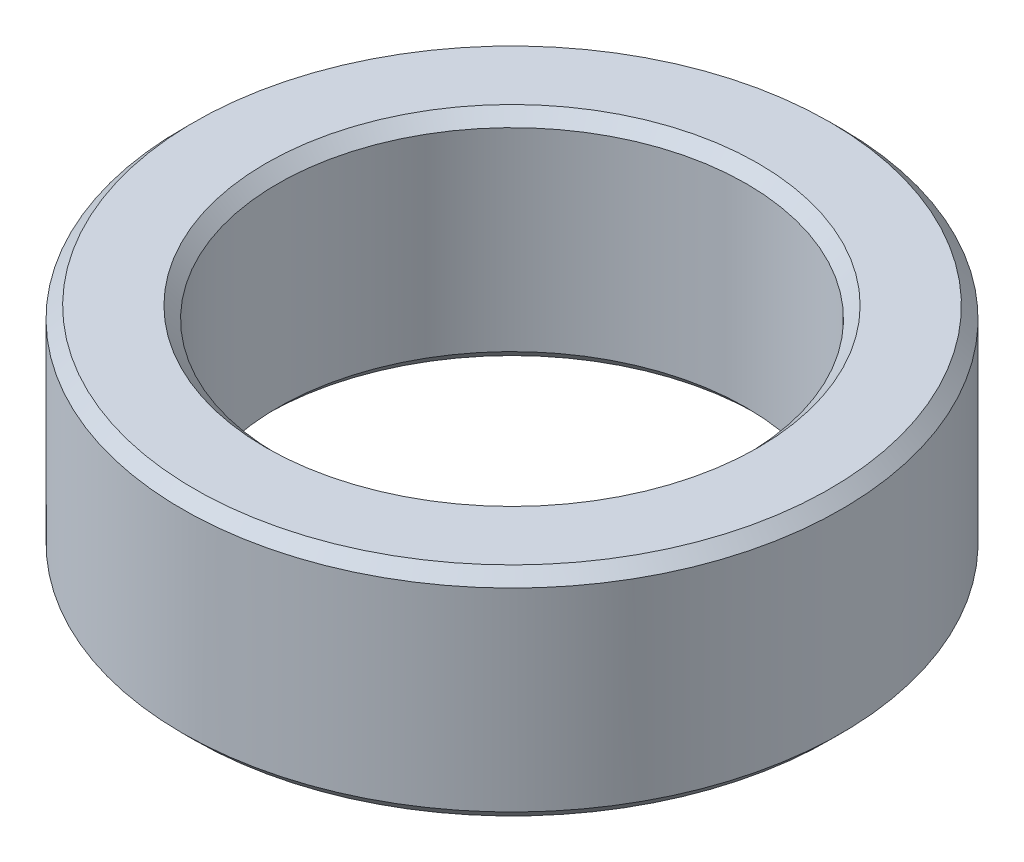
ISO-10303-21;
HEADER;
FILE_DESCRIPTION(('STEP AP214'),'2;1');
FILE_NAME('part.step','',(''),(''),'','','');
FILE_SCHEMA(('AUTOMOTIVE_DESIGN { 1 0 10303 214 1 1 1 1 }'));
ENDSEC;
DATA;
#1=APPLICATION_CONTEXT('core data for automotive mechanical design processes');
#2=APPLICATION_PROTOCOL_DEFINITION('international standard','automotive_design',2000,#1);
#3=PRODUCT_CONTEXT('',#1,'mechanical');
#4=PRODUCT('Part','Part','',(#3));
#5=PRODUCT_RELATED_PRODUCT_CATEGORY('part','',(#4));
#6=PRODUCT_DEFINITION_FORMATION('','',#4);
#7=PRODUCT_DEFINITION_CONTEXT('part definition',#1,'design');
#8=PRODUCT_DEFINITION('design','',#6,#7);
#9=PRODUCT_DEFINITION_SHAPE('','',#8);
#10=(LENGTH_UNIT() NAMED_UNIT(*) SI_UNIT(.MILLI.,.METRE.));
#11=(NAMED_UNIT(*) PLANE_ANGLE_UNIT() SI_UNIT($,.RADIAN.));
#12=(NAMED_UNIT(*) SI_UNIT($,.STERADIAN.) SOLID_ANGLE_UNIT());
#13=UNCERTAINTY_MEASURE_WITH_UNIT(LENGTH_MEASURE(1.E-05),#10,'distance_accuracy_value','');
#14=(GEOMETRIC_REPRESENTATION_CONTEXT(3) GLOBAL_UNCERTAINTY_ASSIGNED_CONTEXT((#13)) GLOBAL_UNIT_ASSIGNED_CONTEXT((#10,
#11,#12)) REPRESENTATION_CONTEXT('',''));
#15=CARTESIAN_POINT('',(0.,0.,0.));
#16=DIRECTION('',(0.,0.,1.));
#17=DIRECTION('',(1.,0.,0.));
#18=AXIS2_PLACEMENT_3D('',#15,#16,#17);
#19=CARTESIAN_POINT('',(0.,32.9915013435077,0.));
#20=DIRECTION('',(0.,-1.,0.));
#21=DIRECTION('',(0.,0.,-1.));
#22=AXIS2_PLACEMENT_3D('',#19,#20,#21);
#23=CYLINDRICAL_SURFACE('',#22,50.);
#24=CARTESIAN_POINT('',(0.,1.78442094857238,0.));
#25=DIRECTION('',(0.,1.,0.));
#26=DIRECTION('',(0.,0.,1.));
#27=AXIS2_PLACEMENT_3D('',#24,#25,#26);
#28=CIRCLE('',#27,50.);
#29=CARTESIAN_POINT('',(0.,1.78442094857238,50.));
#30=VERTEX_POINT('',#29);
#31=EDGE_CURVE('E10',#30,#30,#28,.T.);
#32=ORIENTED_EDGE('',*,*,#31,.T.);
#33=EDGE_LOOP('',(#32));
#34=FACE_BOUND('',#33,.T.);
#35=CARTESIAN_POINT('',(0.,31.2070803949353,0.));
#36=DIRECTION('',(0.,1.,0.));
#37=DIRECTION('',(0.,0.,1.));
#38=AXIS2_PLACEMENT_3D('',#35,#36,#37);
#39=CIRCLE('',#38,50.);
#40=CARTESIAN_POINT('',(0.,31.2070803949353,-50.));
#41=VERTEX_POINT('',#40);
#42=EDGE_CURVE('E50',#41,#41,#39,.F.);
#43=ORIENTED_EDGE('',*,*,#42,.T.);
#44=EDGE_LOOP('',(#43));
#45=FACE_BOUND('',#44,.T.);
#46=ADVANCED_FACE('F39',(#34,#45),#23,.T.);
#47=CARTESIAN_POINT('',(0.,32.9915013435077,0.));
#48=DIRECTION('',(0.,1.,0.));
#49=DIRECTION('',(0.,0.,1.));
#50=AXIS2_PLACEMENT_3D('',#47,#48,#49);
#51=PLANE('',#50);
#52=CARTESIAN_POINT('',(0.,32.9915013435077,0.));
#53=DIRECTION('',(0.,1.,0.));
#54=DIRECTION('',(0.,0.,1.));
#55=AXIS2_PLACEMENT_3D('',#52,#53,#54);
#56=CIRCLE('',#55,37.349321574819);
#57=CARTESIAN_POINT('',(0.,32.9915013435077,37.349321574819));
#58=VERTEX_POINT('',#57);
#59=EDGE_CURVE('E58',#58,#58,#56,.F.);
#60=ORIENTED_EDGE('',*,*,#59,.T.);
#61=EDGE_LOOP('',(#60));
#62=FACE_BOUND('',#61,.T.);
#63=CARTESIAN_POINT('',(0.,32.9915013435077,0.));
#64=DIRECTION('',(0.,1.,0.));
#65=DIRECTION('',(0.,0.,1.));
#66=AXIS2_PLACEMENT_3D('',#63,#64,#65);
#67=CIRCLE('',#66,48.2155790514276);
#68=CARTESIAN_POINT('',(0.,32.9915013435077,-48.2155790514276));
#69=VERTEX_POINT('',#68);
#70=EDGE_CURVE('E61',#69,#69,#67,.T.);
#71=ORIENTED_EDGE('',*,*,#70,.T.);
#72=EDGE_LOOP('',(#71));
#73=FACE_BOUND('',#72,.T.);
#74=ADVANCED_FACE('F88',(#62,#73),#51,.T.);
#75=CARTESIAN_POINT('',(0.,0.,0.));
#76=DIRECTION('',(0.,1.,0.));
#77=DIRECTION('',(0.,0.,1.));
#78=AXIS2_PLACEMENT_3D('',#75,#76,#77);
#79=PLANE('',#78);
#80=CARTESIAN_POINT('',(0.,0.,0.));
#81=DIRECTION('',(0.,1.,0.));
#82=DIRECTION('',(0.,0.,1.));
#83=AXIS2_PLACEMENT_3D('',#80,#81,#82);
#84=CIRCLE('',#83,37.349321574819);
#85=CARTESIAN_POINT('',(0.,0.,37.349321574819));
#86=VERTEX_POINT('',#85);
#87=EDGE_CURVE('E51',#86,#86,#84,.T.);
#88=ORIENTED_EDGE('',*,*,#87,.T.);
#89=EDGE_LOOP('',(#88));
#90=FACE_BOUND('',#89,.T.);
#91=CARTESIAN_POINT('',(0.,0.,0.));
#92=DIRECTION('',(0.,1.,0.));
#93=DIRECTION('',(0.,0.,1.));
#94=AXIS2_PLACEMENT_3D('',#91,#92,#93);
#95=CIRCLE('',#94,48.2155790514276);
#96=CARTESIAN_POINT('',(0.,0.,48.2155790514276));
#97=VERTEX_POINT('',#96);
#98=EDGE_CURVE('E54',#97,#97,#95,.F.);
#99=ORIENTED_EDGE('',*,*,#98,.T.);
#100=EDGE_LOOP('',(#99));
#101=FACE_BOUND('',#100,.T.);
#102=ADVANCED_FACE('F83',(#90,#101),#79,.F.);
#103=CARTESIAN_POINT('',(0.,32.9915013435077,0.));
#104=DIRECTION('',(0.,-1.,0.));
#105=DIRECTION('',(0.,0.,-1.));
#106=AXIS2_PLACEMENT_3D('',#103,#104,#105);
#107=CYLINDRICAL_SURFACE('',#106,35.5649006262467);
#108=CARTESIAN_POINT('',(0.,31.2070803949353,0.));
#109=DIRECTION('',(0.,1.,0.));
#110=DIRECTION('',(0.,0.,1.));
#111=AXIS2_PLACEMENT_3D('',#108,#109,#110);
#112=CIRCLE('',#111,35.5649006262467);
#113=CARTESIAN_POINT('',(0.,31.2070803949353,35.5649006262467));
#114=VERTEX_POINT('',#113);
#115=EDGE_CURVE('E67',#114,#114,#112,.T.);
#116=ORIENTED_EDGE('',*,*,#115,.T.);
#117=EDGE_LOOP('',(#116));
#118=FACE_BOUND('',#117,.T.);
#119=CARTESIAN_POINT('',(0.,1.78442094857237,0.));
#120=DIRECTION('',(0.,1.,0.));
#121=DIRECTION('',(0.,0.,1.));
#122=AXIS2_PLACEMENT_3D('',#119,#120,#121);
#123=CIRCLE('',#122,35.5649006262467);
#124=CARTESIAN_POINT('',(0.,1.78442094857237,35.5649006262467));
#125=VERTEX_POINT('',#124);
#126=EDGE_CURVE('E69',#125,#125,#123,.F.);
#127=ORIENTED_EDGE('',*,*,#126,.T.);
#128=EDGE_LOOP('',(#127));
#129=FACE_BOUND('',#128,.T.);
#130=ADVANCED_FACE('F71',(#118,#129),#107,.F.);
#131=CARTESIAN_POINT('',(0.,31.2070803949353,0.));
#132=DIRECTION('',(0.,1.,0.));
#133=DIRECTION('',(0.,0.,1.));
#134=AXIS2_PLACEMENT_3D('',#131,#132,#133);
#135=CONICAL_SURFACE('',#134,35.5649006262467,0.785398163397448);
#136=ORIENTED_EDGE('',*,*,#59,.F.);
#137=EDGE_LOOP('',(#136));
#138=FACE_BOUND('',#137,.T.);
#139=ORIENTED_EDGE('',*,*,#115,.F.);
#140=EDGE_LOOP('',(#139));
#141=FACE_BOUND('',#140,.T.);
#142=ADVANCED_FACE('F77',(#138,#141),#135,.F.);
#143=CARTESIAN_POINT('',(0.,0.,0.));
#144=DIRECTION('',(0.,-1.,0.));
#145=DIRECTION('',(0.,0.,-1.));
#146=AXIS2_PLACEMENT_3D('',#143,#144,#145);
#147=CONICAL_SURFACE('',#146,37.349321574819,0.785398163397446);
#148=ORIENTED_EDGE('',*,*,#126,.F.);
#149=EDGE_LOOP('',(#148));
#150=FACE_BOUND('',#149,.T.);
#151=ORIENTED_EDGE('',*,*,#87,.F.);
#152=EDGE_LOOP('',(#151));
#153=FACE_BOUND('',#152,.T.);
#154=ADVANCED_FACE('F73',(#150,#153),#147,.F.);
#155=CARTESIAN_POINT('',(0.,1.78442094857238,0.));
#156=DIRECTION('',(0.,1.,0.));
#157=DIRECTION('',(0.,0.,1.));
#158=AXIS2_PLACEMENT_3D('',#155,#156,#157);
#159=CONICAL_SURFACE('',#158,50.,0.785398163397452);
#160=ORIENTED_EDGE('',*,*,#98,.F.);
#161=EDGE_LOOP('',(#160));
#162=FACE_BOUND('',#161,.T.);
#163=ORIENTED_EDGE('',*,*,#31,.F.);
#164=EDGE_LOOP('',(#163));
#165=FACE_BOUND('',#164,.T.);
#166=ADVANCED_FACE('F76',(#162,#165),#159,.T.);
#167=CARTESIAN_POINT('',(0.,32.9915013435077,0.));
#168=DIRECTION('',(0.,-1.,0.));
#169=DIRECTION('',(0.,0.,-1.));
#170=AXIS2_PLACEMENT_3D('',#167,#168,#169);
#171=CONICAL_SURFACE('',#170,48.2155790514276,0.785398163397443);
#172=CARTESIAN_POINT('',(0.,31.2070803949353,-50.));
#173=CARTESIAN_POINT('',(0.,31.2256681131496,-49.9814122817857));
#174=CARTESIAN_POINT('',(0.,31.2442558313639,-49.9628245635714));
#175=CARTESIAN_POINT('',(0.,31.2814312677924,-49.9256491271428));
#176=CARTESIAN_POINT('',(0.,31.3000189860067,-49.9070614089285));
#177=CARTESIAN_POINT('',(0.,31.3371944224353,-49.8698859724999));
#178=CARTESIAN_POINT('',(0.,31.3557821406496,-49.8512982542856));
#179=CARTESIAN_POINT('',(0.,31.3929575770782,-49.814122817857));
#180=CARTESIAN_POINT('',(0.,31.4115452952925,-49.7955350996428));
#181=CARTESIAN_POINT('',(0.,31.4487207317211,-49.7583596632142));
#182=CARTESIAN_POINT('',(0.,31.4673084499354,-49.7397719449999));
#183=CARTESIAN_POINT('',(0.,31.504483886364,-49.7025965085713));
#184=CARTESIAN_POINT('',(0.,31.5230716045783,-49.684008790357));
#185=CARTESIAN_POINT('',(0.,31.5602470410069,-49.6468333539284));
#186=CARTESIAN_POINT('',(0.,31.5788347592212,-49.6282456357141));
#187=CARTESIAN_POINT('',(0.,31.6160101956498,-49.5910701992855));
#188=CARTESIAN_POINT('',(0.,31.6345979138641,-49.5724824810712));
#189=CARTESIAN_POINT('',(0.,31.6717733502927,-49.5353070446426));
#190=CARTESIAN_POINT('',(0.,31.690361068507,-49.5167193264283));
#191=CARTESIAN_POINT('',(0.,31.7275365049355,-49.4795438899997));
#192=CARTESIAN_POINT('',(0.,31.7461242231498,-49.4609561717854));
#193=CARTESIAN_POINT('',(0.,31.7832996595784,-49.4237807353568));
#194=CARTESIAN_POINT('',(0.,31.8018873777927,-49.4051930171426));
#195=CARTESIAN_POINT('',(0.,31.8390628142213,-49.368017580714));
#196=CARTESIAN_POINT('',(0.,31.8576505324356,-49.3494298624997));
#197=CARTESIAN_POINT('',(0.,31.8948259688642,-49.3122544260711));
#198=CARTESIAN_POINT('',(0.,31.9134136870785,-49.2936667078568));
#199=CARTESIAN_POINT('',(0.,31.9505891235071,-49.2564912714282));
#200=CARTESIAN_POINT('',(0.,31.9691768417214,-49.2379035532139));
#201=CARTESIAN_POINT('',(0.,32.00635227815,-49.2007281167853));
#202=CARTESIAN_POINT('',(0.,32.0249399963643,-49.182140398571));
#203=CARTESIAN_POINT('',(0.,32.0621154327929,-49.1449649621424));
#204=CARTESIAN_POINT('',(0.,32.0807031510072,-49.1263772439281));
#205=CARTESIAN_POINT('',(0.,32.1178785874358,-49.0892018074995));
#206=CARTESIAN_POINT('',(0.,32.1364663056501,-49.0706140892852));
#207=CARTESIAN_POINT('',(0.,32.1736417420786,-49.0334386528566));
#208=CARTESIAN_POINT('',(0.,32.1922294602929,-49.0148509346423));
#209=CARTESIAN_POINT('',(0.,32.2294048967215,-48.9776754982138));
#210=CARTESIAN_POINT('',(0.,32.2479926149358,-48.9590877799995));
#211=CARTESIAN_POINT('',(0.,32.2851680513644,-48.9219123435709));
#212=CARTESIAN_POINT('',(0.,32.3037557695787,-48.9033246253566));
#213=CARTESIAN_POINT('',(0.,32.3409312060073,-48.866149188928));
#214=CARTESIAN_POINT('',(0.,32.3595189242216,-48.8475614707137));
#215=CARTESIAN_POINT('',(0.,32.3966943606502,-48.8103860342851));
#216=CARTESIAN_POINT('',(0.,32.4152820788645,-48.7917983160708));
#217=CARTESIAN_POINT('',(0.,32.4524575152931,-48.7546228796422));
#218=CARTESIAN_POINT('',(0.,32.4710452335074,-48.7360351614279));
#219=CARTESIAN_POINT('',(0.,32.508220669936,-48.6988597249993));
#220=CARTESIAN_POINT('',(0.,32.5268083881503,-48.680272006785));
#221=CARTESIAN_POINT('',(0.,32.5639838245789,-48.6430965703564));
#222=CARTESIAN_POINT('',(0.,32.5825715427932,-48.6245088521421));
#223=CARTESIAN_POINT('',(0.,32.6197469792217,-48.5873334157136));
#224=CARTESIAN_POINT('',(0.,32.638334697436,-48.5687456974993));
#225=CARTESIAN_POINT('',(0.,32.6755101338646,-48.5315702610707));
#226=CARTESIAN_POINT('',(0.,32.6940978520789,-48.5129825428564));
#227=CARTESIAN_POINT('',(0.,32.7312732885075,-48.4758071064278));
#228=CARTESIAN_POINT('',(0.,32.7498610067218,-48.4572193882135));
#229=CARTESIAN_POINT('',(0.,32.7870364431504,-48.4200439517849));
#230=CARTESIAN_POINT('',(0.,32.8056241613647,-48.4014562335706));
#231=CARTESIAN_POINT('',(0.,32.8427995977933,-48.364280797142));
#232=CARTESIAN_POINT('',(0.,32.8613873160076,-48.3456930789277));
#233=CARTESIAN_POINT('',(0.,32.8985627524362,-48.3085176424991));
#234=CARTESIAN_POINT('',(0.,32.9171504706505,-48.2899299242848));
#235=CARTESIAN_POINT('',(0.,32.9543259070791,-48.2527544878562));
#236=CARTESIAN_POINT('',(0.,32.9729136252934,-48.2341667696419));
#237=CARTESIAN_POINT('',(0.,32.9915013435077,-48.2155790514276));
#238=B_SPLINE_CURVE_WITH_KNOTS('',3,(#172,#173,#174,#175,#176,#177,#178,#179,#180,#181,#182,
#183,#184,#185,#186,#187,#188,#189,#190,#191,#192,#193,#194,#195,#196,#197,#198,#199,#200,#201,
#202,#203,#204,#205,#206,#207,#208,#209,#210,#211,#212,#213,#214,#215,#216,#217,#218,#219,#220,
#221,#222,#223,#224,#225,#226,#227,#228,#229,#230,#231,#232,#233,#234,#235,#236,#237),
.UNSPECIFIED.,.F.,.F.,(4,2,2,2,2,2,2,2,2,2,2,2,2,2,2,2,2,2,2,2,2,2,2,2,2,2,2,2,2,2,2,2,4),(0.,
0.0788610095766746,0.157722019153357,0.236583028730039,0.315444038306716,0.394305047883393,
0.47316605746007,0.552027067036752,0.630888076613429,0.709749086190106,0.788610095766788,
0.867471105343465,0.946332114920142,1.02519312449682,1.1040541340735,1.18291514365018,
1.26177615322686,1.34063716280354,1.41949817238022,1.49835918195689,1.57722019153357,
1.65608120111026,1.73494221068693,1.81380322026361,1.89266422984029,1.97152523941697,
2.05038624899365,2.12924725857032,2.20810826814701,2.28696927772368,2.36583028730036,
2.44469129687704,2.52355230645372),.UNSPECIFIED.);
#239=EDGE_CURVE('BSEAM45',#41,#69,#238,.T.);
#240=ORIENTED_EDGE('',*,*,#42,.F.);
#241=ORIENTED_EDGE('',*,*,#70,.F.);
#242=ORIENTED_EDGE('',*,*,#239,.T.);
#243=ORIENTED_EDGE('',*,*,#239,.F.);
#244=EDGE_LOOP('',(#240,#242,#241,#243));
#245=FACE_BOUND('',#244,.T.);
#246=ADVANCED_FACE('F45',(#245),#171,.T.);
#247=CLOSED_SHELL('',(#46,#74,#102,#130,#142,#154,#166,#246));
#248=MANIFOLD_SOLID_BREP('B2',#247);
#249=ADVANCED_BREP_SHAPE_REPRESENTATION('',(#18,#248),#14);
#250=SHAPE_DEFINITION_REPRESENTATION(#9,#249);
ENDSEC;
END-ISO-10303-21;
